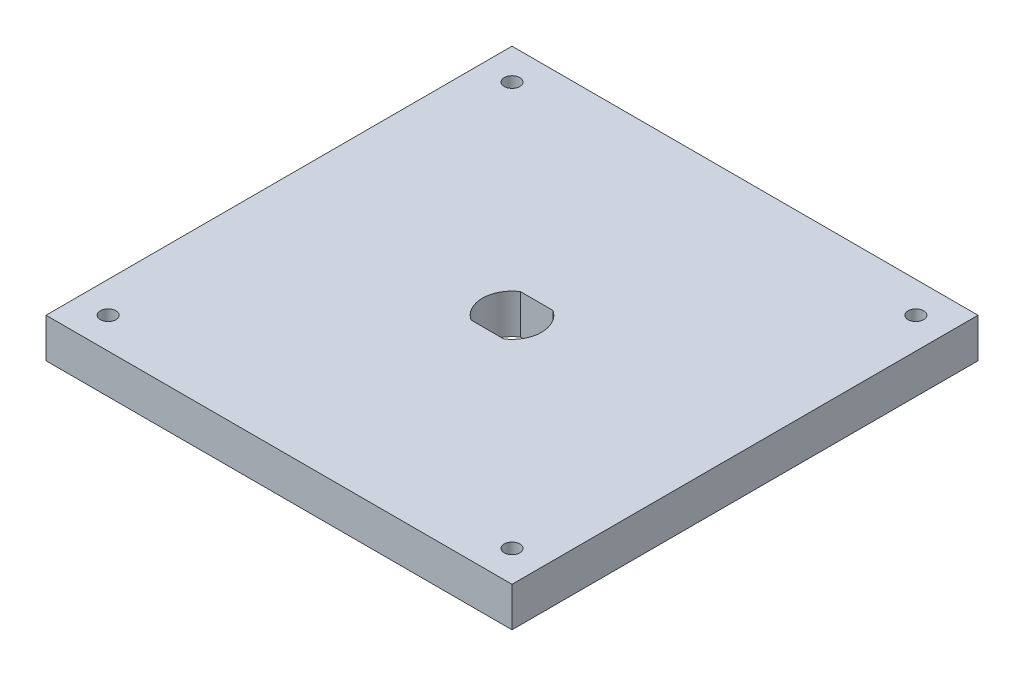
ISO-10303-21;
HEADER;
FILE_DESCRIPTION(('STEP AP214'),'2;1');
FILE_NAME('part.step','',(''),(''),'','','');
FILE_SCHEMA(('AUTOMOTIVE_DESIGN { 1 0 10303 214 1 1 1 1 }'));
ENDSEC;
DATA;
#1=APPLICATION_CONTEXT('core data for automotive mechanical design processes');
#2=APPLICATION_PROTOCOL_DEFINITION('international standard','automotive_design',2000,#1);
#3=PRODUCT_CONTEXT('',#1,'mechanical');
#4=PRODUCT('Part','Part','',(#3));
#5=PRODUCT_RELATED_PRODUCT_CATEGORY('part','',(#4));
#6=PRODUCT_DEFINITION_FORMATION('','',#4);
#7=PRODUCT_DEFINITION_CONTEXT('part definition',#1,'design');
#8=PRODUCT_DEFINITION('design','',#6,#7);
#9=PRODUCT_DEFINITION_SHAPE('','',#8);
#10=(LENGTH_UNIT() NAMED_UNIT(*) SI_UNIT(.MILLI.,.METRE.));
#11=(NAMED_UNIT(*) PLANE_ANGLE_UNIT() SI_UNIT($,.RADIAN.));
#12=(NAMED_UNIT(*) SI_UNIT($,.STERADIAN.) SOLID_ANGLE_UNIT());
#13=UNCERTAINTY_MEASURE_WITH_UNIT(LENGTH_MEASURE(1.E-05),#10,'distance_accuracy_value','');
#14=(GEOMETRIC_REPRESENTATION_CONTEXT(3) GLOBAL_UNCERTAINTY_ASSIGNED_CONTEXT((#13)) GLOBAL_UNIT_ASSIGNED_CONTEXT((#10,
#11,#12)) REPRESENTATION_CONTEXT('',''));
#15=CARTESIAN_POINT('',(0.,0.,0.));
#16=DIRECTION('',(0.,0.,1.));
#17=DIRECTION('',(1.,0.,0.));
#18=AXIS2_PLACEMENT_3D('',#15,#16,#17);
#19=CARTESIAN_POINT('',(0.,12.7,0.));
#20=DIRECTION('',(0.,-1.,0.));
#21=DIRECTION('',(0.,0.,-1.));
#22=AXIS2_PLACEMENT_3D('',#19,#20,#21);
#23=PLANE('',#22);
#24=CARTESIAN_POINT('',(140.,12.7,-10.));
#25=DIRECTION('',(0.,1.,0.));
#26=DIRECTION('',(0.,0.,1.));
#27=AXIS2_PLACEMENT_3D('',#24,#25,#26);
#28=CIRCLE('',#27,2.50000000000002);
#29=CARTESIAN_POINT('',(140.,12.7,-7.50000000000001));
#30=VERTEX_POINT('',#29);
#31=EDGE_CURVE('E277',#30,#30,#28,.T.);
#32=ORIENTED_EDGE('',*,*,#31,.F.);
#33=EDGE_LOOP('',(#32));
#34=FACE_BOUND('',#33,.T.);
#35=CARTESIAN_POINT('',(10.,12.7,-140.));
#36=DIRECTION('',(0.,1.,0.));
#37=DIRECTION('',(0.,0.,1.));
#38=AXIS2_PLACEMENT_3D('',#35,#36,#37);
#39=CIRCLE('',#38,2.5);
#40=CARTESIAN_POINT('',(10.,12.7,-137.5));
#41=VERTEX_POINT('',#40);
#42=EDGE_CURVE('E143',#41,#41,#39,.T.);
#43=ORIENTED_EDGE('',*,*,#42,.F.);
#44=EDGE_LOOP('',(#43));
#45=FACE_BOUND('',#44,.T.);
#46=DIRECTION('',(1.,0.,0.));
#47=VECTOR('',#46,1.);
#48=CARTESIAN_POINT('',(0.,12.7,-67.0625));
#49=LINE('',#48,#47);
#50=CARTESIAN_POINT('',(69.7348581453108,12.7,-67.0625));
#51=VERTEX_POINT('',#50);
#52=CARTESIAN_POINT('',(80.2651418546892,12.7,-67.0625));
#53=VERTEX_POINT('',#52);
#54=EDGE_CURVE('E142',#51,#53,#49,.T.);
#55=ORIENTED_EDGE('',*,*,#54,.F.);
#56=CARTESIAN_POINT('',(75.,12.7,-75.));
#57=DIRECTION('',(0.,1.,0.));
#58=DIRECTION('',(0.,0.,1.));
#59=AXIS2_PLACEMENT_3D('',#56,#57,#58);
#60=CIRCLE('',#59,9.52500000000001);
#61=CARTESIAN_POINT('',(69.7348581453108,12.7,-82.9375));
#62=VERTEX_POINT('',#61);
#63=EDGE_CURVE('E55',#62,#51,#60,.T.);
#64=ORIENTED_EDGE('',*,*,#63,.F.);
#65=DIRECTION('',(1.,0.,0.));
#66=VECTOR('',#65,1.);
#67=CARTESIAN_POINT('',(0.,12.7,-82.9375));
#68=LINE('',#67,#66);
#69=CARTESIAN_POINT('',(80.2651418546892,12.7,-82.9375));
#70=VERTEX_POINT('',#69);
#71=EDGE_CURVE('E126',#62,#70,#68,.T.);
#72=ORIENTED_EDGE('',*,*,#71,.T.);
#73=CARTESIAN_POINT('',(75.,12.7,-75.));
#74=DIRECTION('',(0.,1.,0.));
#75=DIRECTION('',(0.,0.,1.));
#76=AXIS2_PLACEMENT_3D('',#73,#74,#75);
#77=CIRCLE('',#76,9.52500000000001);
#78=EDGE_CURVE('E130',#53,#70,#77,.T.);
#79=ORIENTED_EDGE('',*,*,#78,.F.);
#80=EDGE_LOOP('',(#55,#64,#72,#79));
#81=FACE_BOUND('',#80,.T.);
#82=DIRECTION('',(0.,0.,1.));
#83=VECTOR('',#82,1.);
#84=CARTESIAN_POINT('',(0.,12.7,0.));
#85=LINE('',#84,#83);
#86=CARTESIAN_POINT('',(0.,12.7,-150.));
#87=VERTEX_POINT('',#86);
#88=CARTESIAN_POINT('',(0.,12.7,0.));
#89=VERTEX_POINT('',#88);
#90=EDGE_CURVE('E158',#87,#89,#85,.T.);
#91=ORIENTED_EDGE('',*,*,#90,.T.);
#92=DIRECTION('',(1.,0.,0.));
#93=VECTOR('',#92,1.);
#94=CARTESIAN_POINT('',(0.,12.7,0.));
#95=LINE('',#94,#93);
#96=CARTESIAN_POINT('',(150.,12.7,0.));
#97=VERTEX_POINT('',#96);
#98=EDGE_CURVE('E162',#89,#97,#95,.T.);
#99=ORIENTED_EDGE('',*,*,#98,.T.);
#100=DIRECTION('',(0.,0.,-1.));
#101=VECTOR('',#100,1.);
#102=CARTESIAN_POINT('',(150.,12.7,0.));
#103=LINE('',#102,#101);
#104=CARTESIAN_POINT('',(150.,12.7,-150.));
#105=VERTEX_POINT('',#104);
#106=EDGE_CURVE('E166',#97,#105,#103,.T.);
#107=ORIENTED_EDGE('',*,*,#106,.T.);
#108=DIRECTION('',(-1.,0.,0.));
#109=VECTOR('',#108,1.);
#110=CARTESIAN_POINT('',(0.,12.7,-150.));
#111=LINE('',#110,#109);
#112=EDGE_CURVE('E169',#105,#87,#111,.T.);
#113=ORIENTED_EDGE('',*,*,#112,.T.);
#114=EDGE_LOOP('',(#91,#99,#107,#113));
#115=FACE_BOUND('',#114,.T.);
#116=CARTESIAN_POINT('',(140.,12.7,-140.));
#117=DIRECTION('',(0.,-1.,0.));
#118=DIRECTION('',(0.,0.,-1.));
#119=AXIS2_PLACEMENT_3D('',#116,#117,#118);
#120=CIRCLE('',#119,2.50000000000002);
#121=CARTESIAN_POINT('',(140.,12.7,-142.5));
#122=VERTEX_POINT('',#121);
#123=EDGE_CURVE('E284',#122,#122,#120,.T.);
#124=ORIENTED_EDGE('',*,*,#123,.T.);
#125=EDGE_LOOP('',(#124));
#126=FACE_BOUND('',#125,.T.);
#127=CARTESIAN_POINT('',(10.,12.7,-10.));
#128=DIRECTION('',(0.,-1.,0.));
#129=DIRECTION('',(0.,0.,-1.));
#130=AXIS2_PLACEMENT_3D('',#127,#128,#129);
#131=CIRCLE('',#130,2.5);
#132=CARTESIAN_POINT('',(10.,12.7,-12.5));
#133=VERTEX_POINT('',#132);
#134=EDGE_CURVE('E286',#133,#133,#131,.T.);
#135=ORIENTED_EDGE('',*,*,#134,.T.);
#136=EDGE_LOOP('',(#135));
#137=FACE_BOUND('',#136,.T.);
#138=ADVANCED_FACE('F39',(#34,#45,#81,#115,#126,#137),#23,.F.);
#139=CARTESIAN_POINT('',(0.,0.,0.));
#140=DIRECTION('',(0.,-1.,0.));
#141=DIRECTION('',(0.,0.,-1.));
#142=AXIS2_PLACEMENT_3D('',#139,#140,#141);
#143=PLANE('',#142);
#144=CARTESIAN_POINT('',(140.,0.,-140.));
#145=DIRECTION('',(0.,-1.,0.));
#146=DIRECTION('',(0.,0.,-1.));
#147=AXIS2_PLACEMENT_3D('',#144,#145,#146);
#148=CIRCLE('',#147,2.50000000000002);
#149=CARTESIAN_POINT('',(140.,0.,-142.5));
#150=VERTEX_POINT('',#149);
#151=EDGE_CURVE('E279',#150,#150,#148,.T.);
#152=ORIENTED_EDGE('',*,*,#151,.F.);
#153=EDGE_LOOP('',(#152));
#154=FACE_BOUND('',#153,.T.);
#155=CARTESIAN_POINT('',(10.,0.,-140.));
#156=DIRECTION('',(0.,1.,0.));
#157=DIRECTION('',(0.,0.,1.));
#158=AXIS2_PLACEMENT_3D('',#155,#156,#157);
#159=CIRCLE('',#158,2.5);
#160=CARTESIAN_POINT('',(10.,0.,-137.5));
#161=VERTEX_POINT('',#160);
#162=EDGE_CURVE('E301',#161,#161,#159,.T.);
#163=ORIENTED_EDGE('',*,*,#162,.T.);
#164=EDGE_LOOP('',(#163));
#165=FACE_BOUND('',#164,.T.);
#166=CARTESIAN_POINT('',(75.,0.,-75.));
#167=DIRECTION('',(0.,1.,0.));
#168=DIRECTION('',(0.,0.,1.));
#169=AXIS2_PLACEMENT_3D('',#166,#167,#168);
#170=CIRCLE('',#169,9.52500000000001);
#171=CARTESIAN_POINT('',(69.7348581453108,0.,-82.9375));
#172=VERTEX_POINT('',#171);
#173=CARTESIAN_POINT('',(69.7348581453108,0.,-67.0625));
#174=VERTEX_POINT('',#173);
#175=EDGE_CURVE('E108',#172,#174,#170,.T.);
#176=ORIENTED_EDGE('',*,*,#175,.T.);
#177=DIRECTION('',(1.,0.,0.));
#178=VECTOR('',#177,1.);
#179=CARTESIAN_POINT('',(0.,0.,-67.0625));
#180=LINE('',#179,#178);
#181=CARTESIAN_POINT('',(80.2651418546892,0.,-67.0625));
#182=VERTEX_POINT('',#181);
#183=EDGE_CURVE('E118',#174,#182,#180,.T.);
#184=ORIENTED_EDGE('',*,*,#183,.T.);
#185=CARTESIAN_POINT('',(75.,0.,-75.));
#186=DIRECTION('',(0.,1.,0.));
#187=DIRECTION('',(0.,0.,1.));
#188=AXIS2_PLACEMENT_3D('',#185,#186,#187);
#189=CIRCLE('',#188,9.52500000000001);
#190=CARTESIAN_POINT('',(80.2651418546892,0.,-82.9375));
#191=VERTEX_POINT('',#190);
#192=EDGE_CURVE('E63',#182,#191,#189,.T.);
#193=ORIENTED_EDGE('',*,*,#192,.T.);
#194=DIRECTION('',(1.,0.,0.));
#195=VECTOR('',#194,1.);
#196=CARTESIAN_POINT('',(0.,0.,-82.9375));
#197=LINE('',#196,#195);
#198=EDGE_CURVE('E115',#172,#191,#197,.T.);
#199=ORIENTED_EDGE('',*,*,#198,.F.);
#200=EDGE_LOOP('',(#176,#184,#193,#199));
#201=FACE_BOUND('',#200,.T.);
#202=DIRECTION('',(0.,0.,1.));
#203=VECTOR('',#202,1.);
#204=CARTESIAN_POINT('',(0.,0.,0.));
#205=LINE('',#204,#203);
#206=CARTESIAN_POINT('',(0.,0.,-150.));
#207=VERTEX_POINT('',#206);
#208=CARTESIAN_POINT('',(0.,0.,0.));
#209=VERTEX_POINT('',#208);
#210=EDGE_CURVE('E152',#207,#209,#205,.T.);
#211=ORIENTED_EDGE('',*,*,#210,.F.);
#212=DIRECTION('',(-1.,0.,0.));
#213=VECTOR('',#212,1.);
#214=CARTESIAN_POINT('',(0.,0.,-150.));
#215=LINE('',#214,#213);
#216=CARTESIAN_POINT('',(150.,0.,-150.));
#217=VERTEX_POINT('',#216);
#218=EDGE_CURVE('E163',#217,#207,#215,.T.);
#219=ORIENTED_EDGE('',*,*,#218,.F.);
#220=DIRECTION('',(0.,0.,-1.));
#221=VECTOR('',#220,1.);
#222=CARTESIAN_POINT('',(150.,0.,0.));
#223=LINE('',#222,#221);
#224=CARTESIAN_POINT('',(150.,0.,0.));
#225=VERTEX_POINT('',#224);
#226=EDGE_CURVE('E179',#225,#217,#223,.T.);
#227=ORIENTED_EDGE('',*,*,#226,.F.);
#228=DIRECTION('',(1.,0.,0.));
#229=VECTOR('',#228,1.);
#230=CARTESIAN_POINT('',(0.,0.,0.));
#231=LINE('',#230,#229);
#232=EDGE_CURVE('E176',#209,#225,#231,.T.);
#233=ORIENTED_EDGE('',*,*,#232,.F.);
#234=EDGE_LOOP('',(#211,#219,#227,#233));
#235=FACE_BOUND('',#234,.T.);
#236=CARTESIAN_POINT('',(140.,0.,-10.));
#237=DIRECTION('',(0.,1.,0.));
#238=DIRECTION('',(0.,0.,1.));
#239=AXIS2_PLACEMENT_3D('',#236,#237,#238);
#240=CIRCLE('',#239,2.50000000000002);
#241=CARTESIAN_POINT('',(140.,0.,-7.50000000000001));
#242=VERTEX_POINT('',#241);
#243=EDGE_CURVE('E275',#242,#242,#240,.T.);
#244=ORIENTED_EDGE('',*,*,#243,.T.);
#245=EDGE_LOOP('',(#244));
#246=FACE_BOUND('',#245,.T.);
#247=CARTESIAN_POINT('',(10.,0.,-10.));
#248=DIRECTION('',(0.,-1.,0.));
#249=DIRECTION('',(0.,0.,-1.));
#250=AXIS2_PLACEMENT_3D('',#247,#248,#249);
#251=CIRCLE('',#250,2.5);
#252=CARTESIAN_POINT('',(10.,0.,-12.5));
#253=VERTEX_POINT('',#252);
#254=EDGE_CURVE('E133',#253,#253,#251,.T.);
#255=ORIENTED_EDGE('',*,*,#254,.F.);
#256=EDGE_LOOP('',(#255));
#257=FACE_BOUND('',#256,.T.);
#258=ADVANCED_FACE('F123',(#154,#165,#201,#235,#246,#257),#143,.T.);
#259=CARTESIAN_POINT('',(0.,12.7,0.));
#260=DIRECTION('',(1.,0.,0.));
#261=DIRECTION('',(0.,0.,-1.));
#262=AXIS2_PLACEMENT_3D('',#259,#260,#261);
#263=PLANE('',#262);
#264=ORIENTED_EDGE('',*,*,#210,.T.);
#265=DIRECTION('',(0.,-1.,0.));
#266=VECTOR('',#265,1.);
#267=CARTESIAN_POINT('',(0.,12.7,0.));
#268=LINE('',#267,#266);
#269=EDGE_CURVE('E11',#89,#209,#268,.T.);
#270=ORIENTED_EDGE('',*,*,#269,.F.);
#271=ORIENTED_EDGE('',*,*,#90,.F.);
#272=DIRECTION('',(0.,-1.,0.));
#273=VECTOR('',#272,1.);
#274=CARTESIAN_POINT('',(0.,12.7,-150.));
#275=LINE('',#274,#273);
#276=EDGE_CURVE('E172',#87,#207,#275,.T.);
#277=ORIENTED_EDGE('',*,*,#276,.T.);
#278=EDGE_LOOP('',(#264,#270,#271,#277));
#279=FACE_BOUND('',#278,.T.);
#280=ADVANCED_FACE('F41',(#279),#263,.F.);
#281=CARTESIAN_POINT('',(0.,12.7,0.));
#282=DIRECTION('',(0.,0.,-1.));
#283=DIRECTION('',(-1.,0.,0.));
#284=AXIS2_PLACEMENT_3D('',#281,#282,#283);
#285=PLANE('',#284);
#286=ORIENTED_EDGE('',*,*,#232,.T.);
#287=DIRECTION('',(0.,-1.,0.));
#288=VECTOR('',#287,1.);
#289=CARTESIAN_POINT('',(150.,12.7,0.));
#290=LINE('',#289,#288);
#291=EDGE_CURVE('E48',#97,#225,#290,.T.);
#292=ORIENTED_EDGE('',*,*,#291,.F.);
#293=ORIENTED_EDGE('',*,*,#98,.F.);
#294=ORIENTED_EDGE('',*,*,#269,.T.);
#295=EDGE_LOOP('',(#286,#292,#293,#294));
#296=FACE_BOUND('',#295,.T.);
#297=ADVANCED_FACE('F211',(#296),#285,.F.);
#298=CARTESIAN_POINT('',(150.,12.7,0.));
#299=DIRECTION('',(-1.,0.,0.));
#300=DIRECTION('',(0.,0.,1.));
#301=AXIS2_PLACEMENT_3D('',#298,#299,#300);
#302=PLANE('',#301);
#303=ORIENTED_EDGE('',*,*,#226,.T.);
#304=DIRECTION('',(0.,-1.,0.));
#305=VECTOR('',#304,1.);
#306=CARTESIAN_POINT('',(150.,12.7,-150.));
#307=LINE('',#306,#305);
#308=EDGE_CURVE('E187',#105,#217,#307,.T.);
#309=ORIENTED_EDGE('',*,*,#308,.F.);
#310=ORIENTED_EDGE('',*,*,#106,.F.);
#311=ORIENTED_EDGE('',*,*,#291,.T.);
#312=EDGE_LOOP('',(#303,#309,#310,#311));
#313=FACE_BOUND('',#312,.T.);
#314=ADVANCED_FACE('F196',(#313),#302,.F.);
#315=CARTESIAN_POINT('',(0.,12.7,-150.));
#316=DIRECTION('',(0.,0.,1.));
#317=DIRECTION('',(1.,0.,0.));
#318=AXIS2_PLACEMENT_3D('',#315,#316,#317);
#319=PLANE('',#318);
#320=ORIENTED_EDGE('',*,*,#218,.T.);
#321=ORIENTED_EDGE('',*,*,#276,.F.);
#322=ORIENTED_EDGE('',*,*,#112,.F.);
#323=ORIENTED_EDGE('',*,*,#308,.T.);
#324=EDGE_LOOP('',(#320,#321,#322,#323));
#325=FACE_BOUND('',#324,.T.);
#326=ADVANCED_FACE('F204',(#325),#319,.F.);
#327=CARTESIAN_POINT('',(75.,0.,-75.));
#328=DIRECTION('',(0.,1.,0.));
#329=DIRECTION('',(0.,0.,1.));
#330=AXIS2_PLACEMENT_3D('',#327,#328,#329);
#331=CYLINDRICAL_SURFACE('',#330,9.52500000000001);
#332=ORIENTED_EDGE('',*,*,#63,.T.);
#333=DIRECTION('',(0.,1.,0.));
#334=VECTOR('',#333,1.);
#335=CARTESIAN_POINT('',(69.7348581453108,0.,-67.0625));
#336=LINE('',#335,#334);
#337=EDGE_CURVE('E104',#174,#51,#336,.T.);
#338=ORIENTED_EDGE('',*,*,#337,.F.);
#339=ORIENTED_EDGE('',*,*,#175,.F.);
#340=DIRECTION('',(0.,1.,0.));
#341=VECTOR('',#340,1.);
#342=CARTESIAN_POINT('',(69.7348581453108,0.,-82.9375));
#343=LINE('',#342,#341);
#344=EDGE_CURVE('E149',#172,#62,#343,.T.);
#345=ORIENTED_EDGE('',*,*,#344,.T.);
#346=EDGE_LOOP('',(#332,#338,#339,#345));
#347=FACE_BOUND('',#346,.T.);
#348=ADVANCED_FACE('F106',(#347),#331,.F.);
#349=CARTESIAN_POINT('',(0.,0.,-82.9375));
#350=DIRECTION('',(0.,0.,1.));
#351=DIRECTION('',(1.,0.,0.));
#352=AXIS2_PLACEMENT_3D('',#349,#350,#351);
#353=PLANE('',#352);
#354=ORIENTED_EDGE('',*,*,#71,.F.);
#355=ORIENTED_EDGE('',*,*,#344,.F.);
#356=ORIENTED_EDGE('',*,*,#198,.T.);
#357=DIRECTION('',(0.,1.,0.));
#358=VECTOR('',#357,1.);
#359=CARTESIAN_POINT('',(80.2651418546892,0.,-82.9375));
#360=LINE('',#359,#358);
#361=EDGE_CURVE('E153',#191,#70,#360,.T.);
#362=ORIENTED_EDGE('',*,*,#361,.T.);
#363=EDGE_LOOP('',(#354,#355,#356,#362));
#364=FACE_BOUND('',#363,.T.);
#365=ADVANCED_FACE('F235',(#364),#353,.T.);
#366=CARTESIAN_POINT('',(75.,0.,-75.));
#367=DIRECTION('',(0.,1.,0.));
#368=DIRECTION('',(0.,0.,1.));
#369=AXIS2_PLACEMENT_3D('',#366,#367,#368);
#370=CYLINDRICAL_SURFACE('',#369,9.52500000000001);
#371=ORIENTED_EDGE('',*,*,#78,.T.);
#372=ORIENTED_EDGE('',*,*,#361,.F.);
#373=ORIENTED_EDGE('',*,*,#192,.F.);
#374=DIRECTION('',(0.,1.,0.));
#375=VECTOR('',#374,1.);
#376=CARTESIAN_POINT('',(80.2651418546892,0.,-67.0625));
#377=LINE('',#376,#375);
#378=EDGE_CURVE('E114',#182,#53,#377,.T.);
#379=ORIENTED_EDGE('',*,*,#378,.T.);
#380=EDGE_LOOP('',(#371,#372,#373,#379));
#381=FACE_BOUND('',#380,.T.);
#382=ADVANCED_FACE('F239',(#381),#370,.F.);
#383=CARTESIAN_POINT('',(0.,0.,-67.0625));
#384=DIRECTION('',(0.,0.,1.));
#385=DIRECTION('',(1.,0.,0.));
#386=AXIS2_PLACEMENT_3D('',#383,#384,#385);
#387=PLANE('',#386);
#388=ORIENTED_EDGE('',*,*,#54,.T.);
#389=ORIENTED_EDGE('',*,*,#378,.F.);
#390=ORIENTED_EDGE('',*,*,#183,.F.);
#391=ORIENTED_EDGE('',*,*,#337,.T.);
#392=EDGE_LOOP('',(#388,#389,#390,#391));
#393=FACE_BOUND('',#392,.T.);
#394=ADVANCED_FACE('F119',(#393),#387,.F.);
#395=CARTESIAN_POINT('',(10.,0.,-140.));
#396=DIRECTION('',(0.,1.,0.));
#397=DIRECTION('',(0.,0.,1.));
#398=AXIS2_PLACEMENT_3D('',#395,#396,#397);
#399=CYLINDRICAL_SURFACE('',#398,2.5);
#400=ORIENTED_EDGE('',*,*,#162,.F.);
#401=EDGE_LOOP('',(#400));
#402=FACE_BOUND('',#401,.T.);
#403=ORIENTED_EDGE('',*,*,#42,.T.);
#404=EDGE_LOOP('',(#403));
#405=FACE_BOUND('',#404,.T.);
#406=ADVANCED_FACE('F251',(#402,#405),#399,.F.);
#407=CARTESIAN_POINT('',(140.,0.,-140.));
#408=DIRECTION('',(0.,1.,0.));
#409=DIRECTION('',(0.,0.,1.));
#410=AXIS2_PLACEMENT_3D('',#407,#408,#409);
#411=CYLINDRICAL_SURFACE('',#410,2.50000000000002);
#412=ORIENTED_EDGE('',*,*,#151,.T.);
#413=EDGE_LOOP('',(#412));
#414=FACE_BOUND('',#413,.T.);
#415=ORIENTED_EDGE('',*,*,#123,.F.);
#416=EDGE_LOOP('',(#415));
#417=FACE_BOUND('',#416,.T.);
#418=ADVANCED_FACE('F255',(#414,#417),#411,.F.);
#419=CARTESIAN_POINT('',(140.,0.,-10.));
#420=DIRECTION('',(0.,1.,0.));
#421=DIRECTION('',(0.,0.,1.));
#422=AXIS2_PLACEMENT_3D('',#419,#420,#421);
#423=CYLINDRICAL_SURFACE('',#422,2.50000000000002);
#424=ORIENTED_EDGE('',*,*,#243,.F.);
#425=EDGE_LOOP('',(#424));
#426=FACE_BOUND('',#425,.T.);
#427=ORIENTED_EDGE('',*,*,#31,.T.);
#428=EDGE_LOOP('',(#427));
#429=FACE_BOUND('',#428,.T.);
#430=ADVANCED_FACE('F261',(#426,#429),#423,.F.);
#431=CARTESIAN_POINT('',(10.,0.,-10.));
#432=DIRECTION('',(0.,1.,0.));
#433=DIRECTION('',(0.,0.,1.));
#434=AXIS2_PLACEMENT_3D('',#431,#432,#433);
#435=CYLINDRICAL_SURFACE('',#434,2.5);
#436=ORIENTED_EDGE('',*,*,#254,.T.);
#437=EDGE_LOOP('',(#436));
#438=FACE_BOUND('',#437,.T.);
#439=ORIENTED_EDGE('',*,*,#134,.F.);
#440=EDGE_LOOP('',(#439));
#441=FACE_BOUND('',#440,.T.);
#442=ADVANCED_FACE('F248',(#438,#441),#435,.F.);
#443=CLOSED_SHELL('',(#138,#258,#280,#297,#314,#326,#348,#365,#382,#394,#406,#418,#430,#442));
#444=MANIFOLD_SOLID_BREP('B2',#443);
#445=ADVANCED_BREP_SHAPE_REPRESENTATION('',(#18,#444),#14);
#446=SHAPE_DEFINITION_REPRESENTATION(#9,#445);
ENDSEC;
END-ISO-10303-21;
